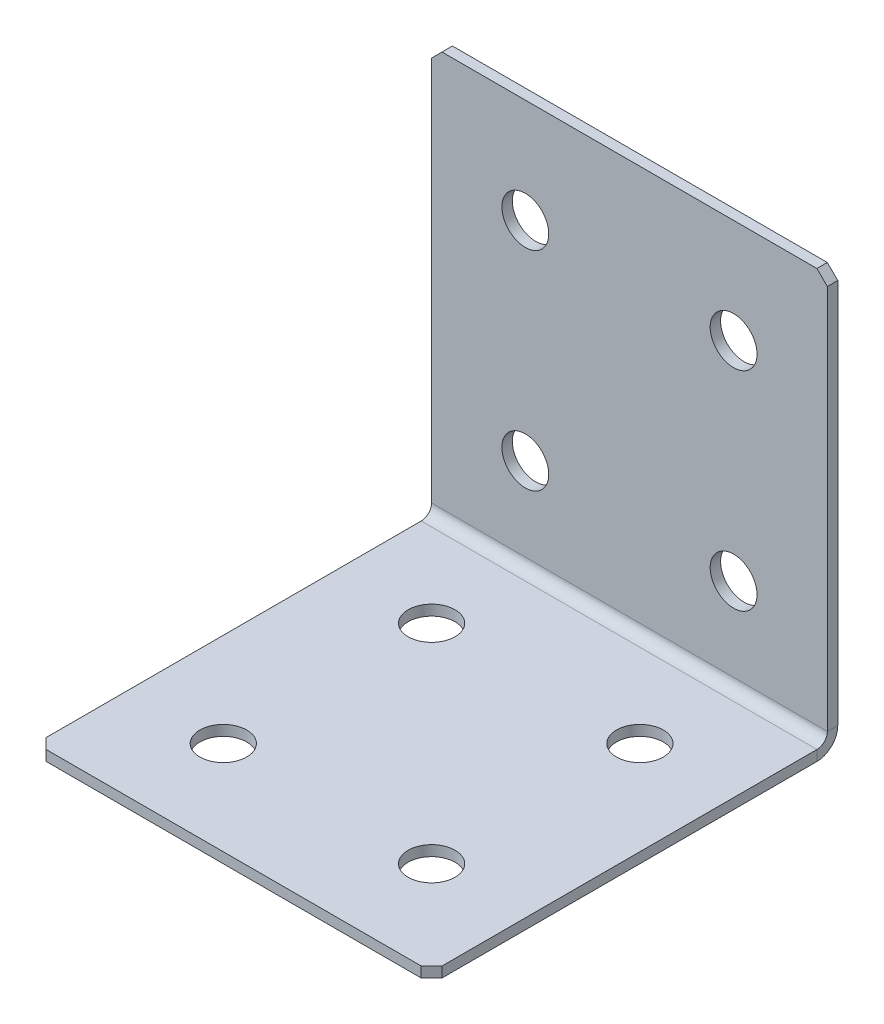
ISO-10303-21;
HEADER;
FILE_DESCRIPTION(('STEP AP214'),'2;1');
FILE_NAME('part.step','',(''),(''),'','','');
FILE_SCHEMA(('AUTOMOTIVE_DESIGN { 1 0 10303 214 1 1 1 1 }'));
ENDSEC;
DATA;
#1=APPLICATION_CONTEXT('core data for automotive mechanical design processes');
#2=APPLICATION_PROTOCOL_DEFINITION('international standard','automotive_design',2000,#1);
#3=PRODUCT_CONTEXT('',#1,'mechanical');
#4=PRODUCT('Part','Part','',(#3));
#5=PRODUCT_RELATED_PRODUCT_CATEGORY('part','',(#4));
#6=PRODUCT_DEFINITION_FORMATION('','',#4);
#7=PRODUCT_DEFINITION_CONTEXT('part definition',#1,'design');
#8=PRODUCT_DEFINITION('design','',#6,#7);
#9=PRODUCT_DEFINITION_SHAPE('','',#8);
#10=(LENGTH_UNIT() NAMED_UNIT(*) SI_UNIT(.MILLI.,.METRE.));
#11=(NAMED_UNIT(*) PLANE_ANGLE_UNIT() SI_UNIT($,.RADIAN.));
#12=(NAMED_UNIT(*) SI_UNIT($,.STERADIAN.) SOLID_ANGLE_UNIT());
#13=UNCERTAINTY_MEASURE_WITH_UNIT(LENGTH_MEASURE(1.E-05),#10,'distance_accuracy_value','');
#14=(GEOMETRIC_REPRESENTATION_CONTEXT(3) GLOBAL_UNCERTAINTY_ASSIGNED_CONTEXT((#13)) GLOBAL_UNIT_ASSIGNED_CONTEXT((#10,
#11,#12)) REPRESENTATION_CONTEXT('',''));
#15=CARTESIAN_POINT('',(0.,0.,0.));
#16=DIRECTION('',(0.,0.,1.));
#17=DIRECTION('',(1.,0.,0.));
#18=AXIS2_PLACEMENT_3D('',#15,#16,#17);
#19=CARTESIAN_POINT('',(0.,0.,2.));
#20=DIRECTION('',(0.,0.,-1.));
#21=DIRECTION('',(-1.,0.,0.));
#22=AXIS2_PLACEMENT_3D('',#19,#20,#21);
#23=PLANE('',#22);
#24=DIRECTION('',(0.,1.,0.));
#25=VECTOR('',#24,1.);
#26=CARTESIAN_POINT('',(38.,0.,2.));
#27=LINE('',#26,#25);
#28=CARTESIAN_POINT('',(38.,3.99999999999999,2.));
#29=VERTEX_POINT('',#28);
#30=CARTESIAN_POINT('',(38.,78.,2.));
#31=VERTEX_POINT('',#30);
#32=EDGE_CURVE('E254',#29,#31,#27,.T.);
#33=ORIENTED_EDGE('',*,*,#32,.T.);
#34=DIRECTION('',(0.707106781186552,-0.707106781186543,0.));
#35=VECTOR('',#34,1.);
#36=CARTESIAN_POINT('',(38.,78.,2.));
#37=LINE('',#36,#35);
#38=CARTESIAN_POINT('',(36.,80.,2.));
#39=VERTEX_POINT('',#38);
#40=EDGE_CURVE('E303',#31,#39,#37,.F.);
#41=ORIENTED_EDGE('',*,*,#40,.T.);
#42=DIRECTION('',(-1.,0.,0.));
#43=VECTOR('',#42,1.);
#44=CARTESIAN_POINT('',(-38.,80.,2.));
#45=LINE('',#44,#43);
#46=CARTESIAN_POINT('',(-36.,80.,2.));
#47=VERTEX_POINT('',#46);
#48=EDGE_CURVE('E259',#39,#47,#45,.T.);
#49=ORIENTED_EDGE('',*,*,#48,.T.);
#50=DIRECTION('',(0.707106781186545,0.70710678118655,0.));
#51=VECTOR('',#50,1.);
#52=CARTESIAN_POINT('',(-36.,80.,2.));
#53=LINE('',#52,#51);
#54=CARTESIAN_POINT('',(-38.,78.,2.));
#55=VERTEX_POINT('',#54);
#56=EDGE_CURVE('E300',#47,#55,#53,.F.);
#57=ORIENTED_EDGE('',*,*,#56,.T.);
#58=DIRECTION('',(0.,-1.,0.));
#59=VECTOR('',#58,1.);
#60=CARTESIAN_POINT('',(-38.,0.,2.));
#61=LINE('',#60,#59);
#62=CARTESIAN_POINT('',(-38.,3.99999999999999,2.));
#63=VERTEX_POINT('',#62);
#64=EDGE_CURVE('E251',#55,#63,#61,.T.);
#65=ORIENTED_EDGE('',*,*,#64,.T.);
#66=DIRECTION('',(1.,0.,0.));
#67=VECTOR('',#66,1.);
#68=CARTESIAN_POINT('',(38.,3.99999999999999,2.));
#69=LINE('',#68,#67);
#70=EDGE_CURVE('E238',#29,#63,#69,.F.);
#71=ORIENTED_EDGE('',*,*,#70,.F.);
#72=EDGE_LOOP('',(#33,#41,#49,#57,#65,#71));
#73=FACE_BOUND('',#72,.T.);
#74=CARTESIAN_POINT('',(20.,59.9999999999999,2.));
#75=DIRECTION('',(0.,0.,1.));
#76=DIRECTION('',(1.,0.,0.));
#77=AXIS2_PLACEMENT_3D('',#74,#75,#76);
#78=CIRCLE('',#77,4.5);
#79=CARTESIAN_POINT('',(24.5,59.9999999999999,2.));
#80=VERTEX_POINT('',#79);
#81=EDGE_CURVE('E759',#80,#80,#78,.T.);
#82=ORIENTED_EDGE('',*,*,#81,.F.);
#83=EDGE_LOOP('',(#82));
#84=FACE_BOUND('',#83,.T.);
#85=CARTESIAN_POINT('',(-20.,59.9999999999999,2.));
#86=DIRECTION('',(0.,0.,1.));
#87=DIRECTION('',(1.,0.,0.));
#88=AXIS2_PLACEMENT_3D('',#85,#86,#87);
#89=CIRCLE('',#88,4.5);
#90=CARTESIAN_POINT('',(-15.5,59.9999999999999,2.));
#91=VERTEX_POINT('',#90);
#92=EDGE_CURVE('E751',#91,#91,#89,.T.);
#93=ORIENTED_EDGE('',*,*,#92,.F.);
#94=EDGE_LOOP('',(#93));
#95=FACE_BOUND('',#94,.T.);
#96=CARTESIAN_POINT('',(20.,19.9999999999999,2.));
#97=DIRECTION('',(0.,0.,1.));
#98=DIRECTION('',(1.,0.,0.));
#99=AXIS2_PLACEMENT_3D('',#96,#97,#98);
#100=CIRCLE('',#99,4.5);
#101=CARTESIAN_POINT('',(24.5,19.9999999999999,2.));
#102=VERTEX_POINT('',#101);
#103=EDGE_CURVE('E743',#102,#102,#100,.T.);
#104=ORIENTED_EDGE('',*,*,#103,.F.);
#105=EDGE_LOOP('',(#104));
#106=FACE_BOUND('',#105,.T.);
#107=CARTESIAN_POINT('',(-20.,19.9999999999999,2.));
#108=DIRECTION('',(0.,0.,1.));
#109=DIRECTION('',(1.,0.,0.));
#110=AXIS2_PLACEMENT_3D('',#107,#108,#109);
#111=CIRCLE('',#110,4.5);
#112=CARTESIAN_POINT('',(-15.5,19.9999999999999,2.));
#113=VERTEX_POINT('',#112);
#114=EDGE_CURVE('E726',#113,#113,#111,.T.);
#115=ORIENTED_EDGE('',*,*,#114,.F.);
#116=EDGE_LOOP('',(#115));
#117=FACE_BOUND('',#116,.T.);
#118=ADVANCED_FACE('F70',(#73,#84,#95,#106,#117),#23,.F.);
#119=CARTESIAN_POINT('',(38.,0.,2.));
#120=DIRECTION('',(-1.,0.,0.));
#121=DIRECTION('',(0.,1.,0.));
#122=AXIS2_PLACEMENT_3D('',#119,#120,#121);
#123=PLANE('',#122);
#124=DIRECTION('',(0.,1.,0.));
#125=VECTOR('',#124,1.);
#126=CARTESIAN_POINT('',(38.,0.,0.));
#127=LINE('',#126,#125);
#128=CARTESIAN_POINT('',(38.,3.99999999999999,0.));
#129=VERTEX_POINT('',#128);
#130=CARTESIAN_POINT('',(38.,78.,0.));
#131=VERTEX_POINT('',#130);
#132=EDGE_CURVE('E266',#129,#131,#127,.T.);
#133=ORIENTED_EDGE('',*,*,#132,.T.);
#134=DIRECTION('',(0.,0.,-1.));
#135=VECTOR('',#134,1.);
#136=CARTESIAN_POINT('',(38.,78.,2.));
#137=LINE('',#136,#135);
#138=EDGE_CURVE('E296',#131,#31,#137,.F.);
#139=ORIENTED_EDGE('',*,*,#138,.T.);
#140=ORIENTED_EDGE('',*,*,#32,.F.);
#141=DIRECTION('',(0.,0.,-1.));
#142=VECTOR('',#141,1.);
#143=CARTESIAN_POINT('',(38.,3.99999999999999,2.));
#144=LINE('',#143,#142);
#145=EDGE_CURVE('E233',#29,#129,#144,.T.);
#146=ORIENTED_EDGE('',*,*,#145,.T.);
#147=EDGE_LOOP('',(#133,#139,#140,#146));
#148=FACE_BOUND('',#147,.T.);
#149=ADVANCED_FACE('F324',(#148),#123,.F.);
#150=CARTESIAN_POINT('',(0.,0.,0.));
#151=DIRECTION('',(0.,0.,-1.));
#152=DIRECTION('',(-1.,0.,0.));
#153=AXIS2_PLACEMENT_3D('',#150,#151,#152);
#154=PLANE('',#153);
#155=CARTESIAN_POINT('',(-20.,19.9999999999999,0.));
#156=DIRECTION('',(0.,0.,-1.));
#157=DIRECTION('',(-1.,0.,0.));
#158=AXIS2_PLACEMENT_3D('',#155,#156,#157);
#159=CIRCLE('',#158,4.5);
#160=CARTESIAN_POINT('',(-24.5,19.9999999999999,0.));
#161=VERTEX_POINT('',#160);
#162=EDGE_CURVE('E734',#161,#161,#159,.T.);
#163=ORIENTED_EDGE('',*,*,#162,.F.);
#164=EDGE_LOOP('',(#163));
#165=FACE_BOUND('',#164,.T.);
#166=CARTESIAN_POINT('',(20.,19.9999999999999,0.));
#167=DIRECTION('',(0.,0.,-1.));
#168=DIRECTION('',(-1.,0.,0.));
#169=AXIS2_PLACEMENT_3D('',#166,#167,#168);
#170=CIRCLE('',#169,4.5);
#171=CARTESIAN_POINT('',(15.5,19.9999999999999,0.));
#172=VERTEX_POINT('',#171);
#173=EDGE_CURVE('E747',#172,#172,#170,.T.);
#174=ORIENTED_EDGE('',*,*,#173,.F.);
#175=EDGE_LOOP('',(#174));
#176=FACE_BOUND('',#175,.T.);
#177=CARTESIAN_POINT('',(-20.,59.9999999999999,0.));
#178=DIRECTION('',(0.,0.,-1.));
#179=DIRECTION('',(-1.,0.,0.));
#180=AXIS2_PLACEMENT_3D('',#177,#178,#179);
#181=CIRCLE('',#180,4.5);
#182=CARTESIAN_POINT('',(-24.5,59.9999999999999,0.));
#183=VERTEX_POINT('',#182);
#184=EDGE_CURVE('E755',#183,#183,#181,.T.);
#185=ORIENTED_EDGE('',*,*,#184,.F.);
#186=EDGE_LOOP('',(#185));
#187=FACE_BOUND('',#186,.T.);
#188=CARTESIAN_POINT('',(20.,59.9999999999999,0.));
#189=DIRECTION('',(0.,0.,-1.));
#190=DIRECTION('',(-1.,0.,0.));
#191=AXIS2_PLACEMENT_3D('',#188,#189,#190);
#192=CIRCLE('',#191,4.5);
#193=CARTESIAN_POINT('',(15.5,59.9999999999999,0.));
#194=VERTEX_POINT('',#193);
#195=EDGE_CURVE('E228',#194,#194,#192,.T.);
#196=ORIENTED_EDGE('',*,*,#195,.F.);
#197=EDGE_LOOP('',(#196));
#198=FACE_BOUND('',#197,.T.);
#199=DIRECTION('',(-1.,0.,0.));
#200=VECTOR('',#199,1.);
#201=CARTESIAN_POINT('',(0.,80.,0.));
#202=LINE('',#201,#200);
#203=CARTESIAN_POINT('',(36.,80.,0.));
#204=VERTEX_POINT('',#203);
#205=CARTESIAN_POINT('',(-36.,80.,0.));
#206=VERTEX_POINT('',#205);
#207=EDGE_CURVE('E255',#204,#206,#202,.T.);
#208=ORIENTED_EDGE('',*,*,#207,.F.);
#209=DIRECTION('',(-0.707106781186552,0.707106781186543,0.));
#210=VECTOR('',#209,1.);
#211=CARTESIAN_POINT('',(57.9999999999997,58.0000000000005,0.));
#212=LINE('',#211,#210);
#213=EDGE_CURVE('E80',#204,#131,#212,.F.);
#214=ORIENTED_EDGE('',*,*,#213,.T.);
#215=ORIENTED_EDGE('',*,*,#132,.F.);
#216=DIRECTION('',(1.,0.,0.));
#217=VECTOR('',#216,1.);
#218=CARTESIAN_POINT('',(38.,3.99999999999999,0.));
#219=LINE('',#218,#217);
#220=CARTESIAN_POINT('',(-38.,4.00000000000001,0.));
#221=VERTEX_POINT('',#220);
#222=EDGE_CURVE('E169',#129,#221,#219,.F.);
#223=ORIENTED_EDGE('',*,*,#222,.T.);
#224=DIRECTION('',(0.,1.,0.));
#225=VECTOR('',#224,1.);
#226=CARTESIAN_POINT('',(-38.,0.,0.));
#227=LINE('',#226,#225);
#228=CARTESIAN_POINT('',(-38.,78.,0.));
#229=VERTEX_POINT('',#228);
#230=EDGE_CURVE('E248',#229,#221,#227,.F.);
#231=ORIENTED_EDGE('',*,*,#230,.F.);
#232=DIRECTION('',(-0.707106781186545,-0.70710678118655,0.));
#233=VECTOR('',#232,1.);
#234=CARTESIAN_POINT('',(-58.0000000000001,57.9999999999997,0.));
#235=LINE('',#234,#233);
#236=EDGE_CURVE('E92',#229,#206,#235,.F.);
#237=ORIENTED_EDGE('',*,*,#236,.T.);
#238=EDGE_LOOP('',(#208,#214,#215,#223,#231,#237));
#239=FACE_BOUND('',#238,.T.);
#240=ADVANCED_FACE('F319',(#165,#176,#187,#198,#239),#154,.T.);
#241=CARTESIAN_POINT('',(-38.,80.,2.));
#242=DIRECTION('',(0.,-1.,0.));
#243=DIRECTION('',(-1.,0.,0.));
#244=AXIS2_PLACEMENT_3D('',#241,#242,#243);
#245=PLANE('',#244);
#246=ORIENTED_EDGE('',*,*,#48,.F.);
#247=DIRECTION('',(0.,0.,1.));
#248=VECTOR('',#247,1.);
#249=CARTESIAN_POINT('',(36.,80.,2.));
#250=LINE('',#249,#248);
#251=EDGE_CURVE('E310',#39,#204,#250,.F.);
#252=ORIENTED_EDGE('',*,*,#251,.T.);
#253=ORIENTED_EDGE('',*,*,#207,.T.);
#254=DIRECTION('',(0.,0.,-1.));
#255=VECTOR('',#254,1.);
#256=CARTESIAN_POINT('',(-36.,80.,2.));
#257=LINE('',#256,#255);
#258=EDGE_CURVE('E306',#206,#47,#257,.F.);
#259=ORIENTED_EDGE('',*,*,#258,.T.);
#260=EDGE_LOOP('',(#246,#252,#253,#259));
#261=FACE_BOUND('',#260,.T.);
#262=ADVANCED_FACE('F332',(#261),#245,.F.);
#263=CARTESIAN_POINT('',(-38.,0.,2.));
#264=DIRECTION('',(1.,0.,0.));
#265=DIRECTION('',(0.,-1.,0.));
#266=AXIS2_PLACEMENT_3D('',#263,#264,#265);
#267=PLANE('',#266);
#268=ORIENTED_EDGE('',*,*,#64,.F.);
#269=DIRECTION('',(0.,0.,1.));
#270=VECTOR('',#269,1.);
#271=CARTESIAN_POINT('',(-38.,78.,2.));
#272=LINE('',#271,#270);
#273=EDGE_CURVE('E13',#55,#229,#272,.F.);
#274=ORIENTED_EDGE('',*,*,#273,.T.);
#275=ORIENTED_EDGE('',*,*,#230,.T.);
#276=DIRECTION('',(0.,0.,-1.));
#277=VECTOR('',#276,1.);
#278=CARTESIAN_POINT('',(-38.,3.99999999999999,2.));
#279=LINE('',#278,#277);
#280=EDGE_CURVE('E244',#63,#221,#279,.T.);
#281=ORIENTED_EDGE('',*,*,#280,.F.);
#282=EDGE_LOOP('',(#268,#274,#275,#281));
#283=FACE_BOUND('',#282,.T.);
#284=ADVANCED_FACE('F336',(#283),#267,.F.);
#285=CARTESIAN_POINT('',(-38.,3.99999999999999,4.));
#286=DIRECTION('',(-1.,0.,0.));
#287=DIRECTION('',(0.,0.,1.));
#288=AXIS2_PLACEMENT_3D('',#285,#286,#287);
#289=PLANE('',#288);
#290=DIRECTION('',(0.,1.,0.));
#291=VECTOR('',#290,1.);
#292=CARTESIAN_POINT('',(-38.,0.,3.99999999999999));
#293=LINE('',#292,#291);
#294=CARTESIAN_POINT('',(-38.,1.99999999999999,3.99999999999999));
#295=VERTEX_POINT('',#294);
#296=CARTESIAN_POINT('',(-38.,0.,3.99999999999999));
#297=VERTEX_POINT('',#296);
#298=EDGE_CURVE('E224',#295,#297,#293,.F.);
#299=ORIENTED_EDGE('',*,*,#298,.F.);
#300=CARTESIAN_POINT('',(-38.,3.99999999999999,4.));
#301=DIRECTION('',(1.,0.,0.));
#302=DIRECTION('',(0.,0.,-1.));
#303=AXIS2_PLACEMENT_3D('',#300,#301,#302);
#304=CIRCLE('',#303,2.);
#305=EDGE_CURVE('E173',#63,#295,#304,.F.);
#306=ORIENTED_EDGE('',*,*,#305,.F.);
#307=ORIENTED_EDGE('',*,*,#280,.T.);
#308=CARTESIAN_POINT('',(-38.,3.99999999999999,4.));
#309=DIRECTION('',(1.,0.,0.));
#310=DIRECTION('',(0.,0.,-1.));
#311=AXIS2_PLACEMENT_3D('',#308,#309,#310);
#312=CIRCLE('',#311,4.);
#313=EDGE_CURVE('E231',#221,#297,#312,.F.);
#314=ORIENTED_EDGE('',*,*,#313,.T.);
#315=EDGE_LOOP('',(#299,#306,#307,#314));
#316=FACE_BOUND('',#315,.T.);
#317=ADVANCED_FACE('F340',(#316),#289,.T.);
#318=CARTESIAN_POINT('',(38.,3.99999999999999,4.));
#319=DIRECTION('',(-1.,0.,0.));
#320=DIRECTION('',(0.,0.,1.));
#321=AXIS2_PLACEMENT_3D('',#318,#319,#320);
#322=PLANE('',#321);
#323=CARTESIAN_POINT('',(38.,3.99999999999999,4.));
#324=DIRECTION('',(1.,0.,0.));
#325=DIRECTION('',(0.,0.,-1.));
#326=AXIS2_PLACEMENT_3D('',#323,#324,#325);
#327=CIRCLE('',#326,2.);
#328=CARTESIAN_POINT('',(38.,1.99999999999999,3.99999999999999));
#329=VERTEX_POINT('',#328);
#330=EDGE_CURVE('E180',#329,#29,#327,.T.);
#331=ORIENTED_EDGE('',*,*,#330,.F.);
#332=DIRECTION('',(0.,1.,0.));
#333=VECTOR('',#332,1.);
#334=CARTESIAN_POINT('',(38.,1.99999999999999,3.99999999999999));
#335=LINE('',#334,#333);
#336=CARTESIAN_POINT('',(38.,0.,3.99999999999999));
#337=VERTEX_POINT('',#336);
#338=EDGE_CURVE('E177',#329,#337,#335,.F.);
#339=ORIENTED_EDGE('',*,*,#338,.T.);
#340=CARTESIAN_POINT('',(38.,3.99999999999999,4.));
#341=DIRECTION('',(1.,0.,0.));
#342=DIRECTION('',(0.,0.,-1.));
#343=AXIS2_PLACEMENT_3D('',#340,#341,#342);
#344=CIRCLE('',#343,4.);
#345=EDGE_CURVE('E161',#337,#129,#344,.T.);
#346=ORIENTED_EDGE('',*,*,#345,.T.);
#347=ORIENTED_EDGE('',*,*,#145,.F.);
#348=EDGE_LOOP('',(#331,#339,#346,#347));
#349=FACE_BOUND('',#348,.T.);
#350=ADVANCED_FACE('F178',(#349),#322,.F.);
#351=CARTESIAN_POINT('',(38.,3.99999999999999,4.));
#352=DIRECTION('',(1.,0.,0.));
#353=DIRECTION('',(0.,-1.,0.));
#354=AXIS2_PLACEMENT_3D('',#351,#352,#353);
#355=CYLINDRICAL_SURFACE('',#354,4.);
#356=ORIENTED_EDGE('',*,*,#222,.F.);
#357=ORIENTED_EDGE('',*,*,#345,.F.);
#358=DIRECTION('',(1.,0.,0.));
#359=VECTOR('',#358,1.);
#360=CARTESIAN_POINT('',(-38.,0.,3.99999999999999));
#361=LINE('',#360,#359);
#362=EDGE_CURVE('E166',#337,#297,#361,.F.);
#363=ORIENTED_EDGE('',*,*,#362,.T.);
#364=ORIENTED_EDGE('',*,*,#313,.F.);
#365=EDGE_LOOP('',(#356,#357,#363,#364));
#366=FACE_BOUND('',#365,.T.);
#367=ADVANCED_FACE('F163',(#366),#355,.T.);
#368=CARTESIAN_POINT('',(38.,3.99999999999999,4.));
#369=DIRECTION('',(1.,0.,0.));
#370=DIRECTION('',(0.,-1.,0.));
#371=AXIS2_PLACEMENT_3D('',#368,#369,#370);
#372=CYLINDRICAL_SURFACE('',#371,2.);
#373=ORIENTED_EDGE('',*,*,#70,.T.);
#374=ORIENTED_EDGE('',*,*,#305,.T.);
#375=DIRECTION('',(1.,0.,0.));
#376=VECTOR('',#375,1.);
#377=CARTESIAN_POINT('',(-38.,1.99999999999999,3.99999999999999));
#378=LINE('',#377,#376);
#379=EDGE_CURVE('E186',#295,#329,#378,.T.);
#380=ORIENTED_EDGE('',*,*,#379,.T.);
#381=ORIENTED_EDGE('',*,*,#330,.T.);
#382=EDGE_LOOP('',(#373,#374,#380,#381));
#383=FACE_BOUND('',#382,.T.);
#384=ADVANCED_FACE('F343',(#383),#372,.F.);
#385=CARTESIAN_POINT('',(-38.,0.,1.99999999999999));
#386=DIRECTION('',(1.,0.,0.));
#387=DIRECTION('',(0.,0.,-1.));
#388=AXIS2_PLACEMENT_3D('',#385,#386,#387);
#389=PLANE('',#388);
#390=DIRECTION('',(0.,0.,-1.));
#391=VECTOR('',#390,1.);
#392=CARTESIAN_POINT('',(-38.,0.,0.));
#393=LINE('',#392,#391);
#394=CARTESIAN_POINT('',(-38.,-2.58413687848171E-13,76.));
#395=VERTEX_POINT('',#394);
#396=EDGE_CURVE('E194',#395,#297,#393,.T.);
#397=ORIENTED_EDGE('',*,*,#396,.F.);
#398=DIRECTION('',(0.,1.,0.));
#399=VECTOR('',#398,1.);
#400=CARTESIAN_POINT('',(-38.,-2.58369619074392E-13,76.));
#401=LINE('',#400,#399);
#402=CARTESIAN_POINT('',(-38.,1.99999999999974,76.));
#403=VERTEX_POINT('',#402);
#404=EDGE_CURVE('E292',#395,#403,#401,.T.);
#405=ORIENTED_EDGE('',*,*,#404,.T.);
#406=DIRECTION('',(0.,0.,1.));
#407=VECTOR('',#406,1.);
#408=CARTESIAN_POINT('',(-38.,2.,2.));
#409=LINE('',#408,#407);
#410=EDGE_CURVE('E196',#403,#295,#409,.F.);
#411=ORIENTED_EDGE('',*,*,#410,.T.);
#412=ORIENTED_EDGE('',*,*,#298,.T.);
#413=EDGE_LOOP('',(#397,#405,#411,#412));
#414=FACE_BOUND('',#413,.T.);
#415=ADVANCED_FACE('F360',(#414),#389,.F.);
#416=CARTESIAN_POINT('',(38.,-2.65412691824451E-13,78.));
#417=DIRECTION('',(-1.,0.,0.));
#418=DIRECTION('',(0.,0.,1.));
#419=AXIS2_PLACEMENT_3D('',#416,#417,#418);
#420=PLANE('',#419);
#421=DIRECTION('',(0.,0.,-1.));
#422=VECTOR('',#421,1.);
#423=CARTESIAN_POINT('',(38.,1.99999999999973,78.));
#424=LINE('',#423,#422);
#425=CARTESIAN_POINT('',(38.,1.99999999999974,76.));
#426=VERTEX_POINT('',#425);
#427=EDGE_CURVE('E217',#329,#426,#424,.F.);
#428=ORIENTED_EDGE('',*,*,#427,.T.);
#429=DIRECTION('',(0.,-1.,0.));
#430=VECTOR('',#429,1.);
#431=CARTESIAN_POINT('',(38.,-2.58429729146765E-13,76.));
#432=LINE('',#431,#430);
#433=CARTESIAN_POINT('',(38.,-2.58413687848171E-13,76.));
#434=VERTEX_POINT('',#433);
#435=EDGE_CURVE('E200',#426,#434,#432,.T.);
#436=ORIENTED_EDGE('',*,*,#435,.T.);
#437=DIRECTION('',(0.,0.,1.));
#438=VECTOR('',#437,1.);
#439=CARTESIAN_POINT('',(38.,0.,0.));
#440=LINE('',#439,#438);
#441=EDGE_CURVE('E191',#337,#434,#440,.T.);
#442=ORIENTED_EDGE('',*,*,#441,.F.);
#443=ORIENTED_EDGE('',*,*,#338,.F.);
#444=EDGE_LOOP('',(#428,#436,#442,#443));
#445=FACE_BOUND('',#444,.T.);
#446=ADVANCED_FACE('F198',(#445),#420,.F.);
#447=CARTESIAN_POINT('',(0.,0.,0.));
#448=DIRECTION('',(0.,1.,0.));
#449=DIRECTION('',(0.,0.,1.));
#450=AXIS2_PLACEMENT_3D('',#447,#448,#449);
#451=PLANE('',#450);
#452=CARTESIAN_POINT('',(-20.,0.,20.));
#453=DIRECTION('',(0.,1.,0.));
#454=DIRECTION('',(0.,0.,1.));
#455=AXIS2_PLACEMENT_3D('',#452,#453,#454);
#456=CIRCLE('',#455,4.5);
#457=CARTESIAN_POINT('',(-20.,0.,24.5));
#458=VERTEX_POINT('',#457);
#459=EDGE_CURVE('E713',#458,#458,#456,.T.);
#460=ORIENTED_EDGE('',*,*,#459,.T.);
#461=EDGE_LOOP('',(#460));
#462=FACE_BOUND('',#461,.T.);
#463=CARTESIAN_POINT('',(20.,0.,20.));
#464=DIRECTION('',(0.,1.,0.));
#465=DIRECTION('',(0.,0.,1.));
#466=AXIS2_PLACEMENT_3D('',#463,#464,#465);
#467=CIRCLE('',#466,4.5);
#468=CARTESIAN_POINT('',(20.,0.,24.5));
#469=VERTEX_POINT('',#468);
#470=EDGE_CURVE('E717',#469,#469,#467,.T.);
#471=ORIENTED_EDGE('',*,*,#470,.T.);
#472=EDGE_LOOP('',(#471));
#473=FACE_BOUND('',#472,.T.);
#474=CARTESIAN_POINT('',(20.,-2.02528965820292E-13,60.));
#475=DIRECTION('',(0.,1.,0.));
#476=DIRECTION('',(0.,0.,1.));
#477=AXIS2_PLACEMENT_3D('',#474,#475,#476);
#478=CIRCLE('',#477,4.5);
#479=CARTESIAN_POINT('',(20.,-2.18240631845086E-13,64.5));
#480=VERTEX_POINT('',#479);
#481=EDGE_CURVE('E721',#480,#480,#478,.T.);
#482=ORIENTED_EDGE('',*,*,#481,.T.);
#483=EDGE_LOOP('',(#482));
#484=FACE_BOUND('',#483,.T.);
#485=CARTESIAN_POINT('',(-20.,-2.02528965820292E-13,60.));
#486=DIRECTION('',(0.,1.,0.));
#487=DIRECTION('',(0.,0.,1.));
#488=AXIS2_PLACEMENT_3D('',#485,#486,#487);
#489=CIRCLE('',#488,4.5);
#490=CARTESIAN_POINT('',(-20.,-2.18240631845086E-13,64.5));
#491=VERTEX_POINT('',#490);
#492=EDGE_CURVE('E724',#491,#491,#489,.T.);
#493=ORIENTED_EDGE('',*,*,#492,.T.);
#494=EDGE_LOOP('',(#493));
#495=FACE_BOUND('',#494,.T.);
#496=ORIENTED_EDGE('',*,*,#441,.T.);
#497=DIRECTION('',(0.707106781186548,0.,-0.707106781186548));
#498=VECTOR('',#497,1.);
#499=CARTESIAN_POINT('',(36.,-2.65412691824451E-13,78.));
#500=LINE('',#499,#498);
#501=CARTESIAN_POINT('',(36.,-2.65396650525857E-13,78.));
#502=VERTEX_POINT('',#501);
#503=EDGE_CURVE('E289',#434,#502,#500,.F.);
#504=ORIENTED_EDGE('',*,*,#503,.T.);
#505=DIRECTION('',(-1.,0.,0.));
#506=VECTOR('',#505,1.);
#507=CARTESIAN_POINT('',(0.,-2.65396650525857E-13,78.));
#508=LINE('',#507,#506);
#509=CARTESIAN_POINT('',(-36.,-2.65396650525857E-13,78.));
#510=VERTEX_POINT('',#509);
#511=EDGE_CURVE('E202',#502,#510,#508,.T.);
#512=ORIENTED_EDGE('',*,*,#511,.T.);
#513=DIRECTION('',(0.707106781186552,0.,0.707106781186543));
#514=VECTOR('',#513,1.);
#515=CARTESIAN_POINT('',(-38.,-2.58369619074392E-13,76.));
#516=LINE('',#515,#514);
#517=EDGE_CURVE('E286',#510,#395,#516,.F.);
#518=ORIENTED_EDGE('',*,*,#517,.T.);
#519=ORIENTED_EDGE('',*,*,#396,.T.);
#520=ORIENTED_EDGE('',*,*,#362,.F.);
#521=EDGE_LOOP('',(#496,#504,#512,#518,#519,#520));
#522=FACE_BOUND('',#521,.T.);
#523=ADVANCED_FACE('F190',(#462,#473,#484,#495,#522),#451,.F.);
#524=CARTESIAN_POINT('',(0.,2.00000000000001,0.));
#525=DIRECTION('',(0.,1.,0.));
#526=DIRECTION('',(0.,0.,1.));
#527=AXIS2_PLACEMENT_3D('',#524,#525,#526);
#528=PLANE('',#527);
#529=CARTESIAN_POINT('',(-20.,1.99999999999994,20.));
#530=DIRECTION('',(0.,1.,0.));
#531=DIRECTION('',(0.,0.,1.));
#532=AXIS2_PLACEMENT_3D('',#529,#530,#531);
#533=CIRCLE('',#532,4.5);
#534=CARTESIAN_POINT('',(-20.,1.99999999999992,24.5));
#535=VERTEX_POINT('',#534);
#536=EDGE_CURVE('E797',#535,#535,#533,.T.);
#537=ORIENTED_EDGE('',*,*,#536,.F.);
#538=EDGE_LOOP('',(#537));
#539=FACE_BOUND('',#538,.T.);
#540=CARTESIAN_POINT('',(20.,1.99999999999994,20.));
#541=DIRECTION('',(0.,1.,0.));
#542=DIRECTION('',(0.,0.,1.));
#543=AXIS2_PLACEMENT_3D('',#540,#541,#542);
#544=CIRCLE('',#543,4.5);
#545=CARTESIAN_POINT('',(20.,1.99999999999992,24.5));
#546=VERTEX_POINT('',#545);
#547=EDGE_CURVE('E806',#546,#546,#544,.T.);
#548=ORIENTED_EDGE('',*,*,#547,.F.);
#549=EDGE_LOOP('',(#548));
#550=FACE_BOUND('',#549,.T.);
#551=CARTESIAN_POINT('',(20.,1.9999999999998,60.));
#552=DIRECTION('',(0.,1.,0.));
#553=DIRECTION('',(0.,0.,1.));
#554=AXIS2_PLACEMENT_3D('',#551,#552,#553);
#555=CIRCLE('',#554,4.5);
#556=CARTESIAN_POINT('',(20.,1.99999999999978,64.5));
#557=VERTEX_POINT('',#556);
#558=EDGE_CURVE('E830',#557,#557,#555,.T.);
#559=ORIENTED_EDGE('',*,*,#558,.F.);
#560=EDGE_LOOP('',(#559));
#561=FACE_BOUND('',#560,.T.);
#562=CARTESIAN_POINT('',(-20.,1.9999999999998,60.));
#563=DIRECTION('',(0.,1.,0.));
#564=DIRECTION('',(0.,0.,1.));
#565=AXIS2_PLACEMENT_3D('',#562,#563,#564);
#566=CIRCLE('',#565,4.5);
#567=CARTESIAN_POINT('',(-20.,1.99999999999978,64.5));
#568=VERTEX_POINT('',#567);
#569=EDGE_CURVE('E727',#568,#568,#566,.T.);
#570=ORIENTED_EDGE('',*,*,#569,.F.);
#571=EDGE_LOOP('',(#570));
#572=FACE_BOUND('',#571,.T.);
#573=DIRECTION('',(1.,0.,0.));
#574=VECTOR('',#573,1.);
#575=CARTESIAN_POINT('',(-38.,1.99999999999973,78.));
#576=LINE('',#575,#574);
#577=CARTESIAN_POINT('',(36.,1.99999999999973,78.));
#578=VERTEX_POINT('',#577);
#579=CARTESIAN_POINT('',(-36.,1.99999999999973,78.));
#580=VERTEX_POINT('',#579);
#581=EDGE_CURVE('E210',#578,#580,#576,.F.);
#582=ORIENTED_EDGE('',*,*,#581,.F.);
#583=DIRECTION('',(-0.707106781186548,0.,0.707106781186548));
#584=VECTOR('',#583,1.);
#585=CARTESIAN_POINT('',(57.,1.99999999999981,57.));
#586=LINE('',#585,#584);
#587=EDGE_CURVE('E281',#578,#426,#586,.F.);
#588=ORIENTED_EDGE('',*,*,#587,.T.);
#589=ORIENTED_EDGE('',*,*,#427,.F.);
#590=ORIENTED_EDGE('',*,*,#379,.F.);
#591=ORIENTED_EDGE('',*,*,#410,.F.);
#592=DIRECTION('',(-0.707106781186552,0.,-0.707106781186543));
#593=VECTOR('',#592,1.);
#594=CARTESIAN_POINT('',(-56.9999999999997,1.99999999999981,57.0000000000005));
#595=LINE('',#594,#593);
#596=EDGE_CURVE('E278',#403,#580,#595,.F.);
#597=ORIENTED_EDGE('',*,*,#596,.T.);
#598=EDGE_LOOP('',(#582,#588,#589,#590,#591,#597));
#599=FACE_BOUND('',#598,.T.);
#600=ADVANCED_FACE('F347',(#539,#550,#561,#572,#599),#528,.T.);
#601=CARTESIAN_POINT('',(-38.,-2.65412691824451E-13,78.));
#602=DIRECTION('',(0.,0.,-1.));
#603=DIRECTION('',(0.,1.,0.));
#604=AXIS2_PLACEMENT_3D('',#601,#602,#603);
#605=PLANE('',#604);
#606=ORIENTED_EDGE('',*,*,#511,.F.);
#607=DIRECTION('',(0.,1.,0.));
#608=VECTOR('',#607,1.);
#609=CARTESIAN_POINT('',(36.,-2.65412691824451E-13,78.));
#610=LINE('',#609,#608);
#611=EDGE_CURVE('E274',#502,#578,#610,.T.);
#612=ORIENTED_EDGE('',*,*,#611,.T.);
#613=ORIENTED_EDGE('',*,*,#581,.T.);
#614=DIRECTION('',(0.,-1.,0.));
#615=VECTOR('',#614,1.);
#616=CARTESIAN_POINT('',(-36.,-2.65412691824451E-13,78.));
#617=LINE('',#616,#615);
#618=EDGE_CURVE('E263',#580,#510,#617,.T.);
#619=ORIENTED_EDGE('',*,*,#618,.T.);
#620=EDGE_LOOP('',(#606,#612,#613,#619));
#621=FACE_BOUND('',#620,.T.);
#622=ADVANCED_FACE('F354',(#621),#605,.F.);
#623=CARTESIAN_POINT('',(20.,59.9999999999999,2.));
#624=DIRECTION('',(0.,0.,1.));
#625=DIRECTION('',(1.,0.,0.));
#626=AXIS2_PLACEMENT_3D('',#623,#624,#625);
#627=CYLINDRICAL_SURFACE('',#626,4.5);
#628=ORIENTED_EDGE('',*,*,#81,.T.);
#629=EDGE_LOOP('',(#628));
#630=FACE_BOUND('',#629,.T.);
#631=ORIENTED_EDGE('',*,*,#195,.T.);
#632=EDGE_LOOP('',(#631));
#633=FACE_BOUND('',#632,.T.);
#634=ADVANCED_FACE('F480',(#630,#633),#627,.F.);
#635=CARTESIAN_POINT('',(-20.,59.9999999999999,2.));
#636=DIRECTION('',(0.,0.,1.));
#637=DIRECTION('',(1.,0.,0.));
#638=AXIS2_PLACEMENT_3D('',#635,#636,#637);
#639=CYLINDRICAL_SURFACE('',#638,4.5);
#640=ORIENTED_EDGE('',*,*,#92,.T.);
#641=EDGE_LOOP('',(#640));
#642=FACE_BOUND('',#641,.T.);
#643=ORIENTED_EDGE('',*,*,#184,.T.);
#644=EDGE_LOOP('',(#643));
#645=FACE_BOUND('',#644,.T.);
#646=ADVANCED_FACE('F471',(#642,#645),#639,.F.);
#647=CARTESIAN_POINT('',(20.,19.9999999999999,2.));
#648=DIRECTION('',(0.,0.,1.));
#649=DIRECTION('',(1.,0.,0.));
#650=AXIS2_PLACEMENT_3D('',#647,#648,#649);
#651=CYLINDRICAL_SURFACE('',#650,4.5);
#652=ORIENTED_EDGE('',*,*,#103,.T.);
#653=EDGE_LOOP('',(#652));
#654=FACE_BOUND('',#653,.T.);
#655=ORIENTED_EDGE('',*,*,#173,.T.);
#656=EDGE_LOOP('',(#655));
#657=FACE_BOUND('',#656,.T.);
#658=ADVANCED_FACE('F462',(#654,#657),#651,.F.);
#659=CARTESIAN_POINT('',(-20.,19.9999999999999,2.));
#660=DIRECTION('',(0.,0.,1.));
#661=DIRECTION('',(1.,0.,0.));
#662=AXIS2_PLACEMENT_3D('',#659,#660,#661);
#663=CYLINDRICAL_SURFACE('',#662,4.5);
#664=ORIENTED_EDGE('',*,*,#114,.T.);
#665=EDGE_LOOP('',(#664));
#666=FACE_BOUND('',#665,.T.);
#667=ORIENTED_EDGE('',*,*,#162,.T.);
#668=EDGE_LOOP('',(#667));
#669=FACE_BOUND('',#668,.T.);
#670=ADVANCED_FACE('F453',(#666,#669),#663,.F.);
#671=CARTESIAN_POINT('',(-20.,1.9999999999998,60.));
#672=DIRECTION('',(0.,1.,0.));
#673=DIRECTION('',(0.,0.,1.));
#674=AXIS2_PLACEMENT_3D('',#671,#672,#673);
#675=CYLINDRICAL_SURFACE('',#674,4.5);
#676=ORIENTED_EDGE('',*,*,#492,.F.);
#677=EDGE_LOOP('',(#676));
#678=FACE_BOUND('',#677,.T.);
#679=ORIENTED_EDGE('',*,*,#569,.T.);
#680=EDGE_LOOP('',(#679));
#681=FACE_BOUND('',#680,.T.);
#682=ADVANCED_FACE('F444',(#678,#681),#675,.F.);
#683=CARTESIAN_POINT('',(20.,1.9999999999998,60.));
#684=DIRECTION('',(0.,1.,0.));
#685=DIRECTION('',(0.,0.,1.));
#686=AXIS2_PLACEMENT_3D('',#683,#684,#685);
#687=CYLINDRICAL_SURFACE('',#686,4.5);
#688=ORIENTED_EDGE('',*,*,#481,.F.);
#689=EDGE_LOOP('',(#688));
#690=FACE_BOUND('',#689,.T.);
#691=ORIENTED_EDGE('',*,*,#558,.T.);
#692=EDGE_LOOP('',(#691));
#693=FACE_BOUND('',#692,.T.);
#694=ADVANCED_FACE('F435',(#690,#693),#687,.F.);
#695=CARTESIAN_POINT('',(20.,1.99999999999994,20.));
#696=DIRECTION('',(0.,1.,0.));
#697=DIRECTION('',(0.,0.,1.));
#698=AXIS2_PLACEMENT_3D('',#695,#696,#697);
#699=CYLINDRICAL_SURFACE('',#698,4.5);
#700=ORIENTED_EDGE('',*,*,#470,.F.);
#701=EDGE_LOOP('',(#700));
#702=FACE_BOUND('',#701,.T.);
#703=ORIENTED_EDGE('',*,*,#547,.T.);
#704=EDGE_LOOP('',(#703));
#705=FACE_BOUND('',#704,.T.);
#706=ADVANCED_FACE('F426',(#702,#705),#699,.F.);
#707=CARTESIAN_POINT('',(-20.,1.99999999999994,20.));
#708=DIRECTION('',(0.,1.,0.));
#709=DIRECTION('',(0.,0.,1.));
#710=AXIS2_PLACEMENT_3D('',#707,#708,#709);
#711=CYLINDRICAL_SURFACE('',#710,4.5);
#712=ORIENTED_EDGE('',*,*,#459,.F.);
#713=EDGE_LOOP('',(#712));
#714=FACE_BOUND('',#713,.T.);
#715=ORIENTED_EDGE('',*,*,#536,.T.);
#716=EDGE_LOOP('',(#715));
#717=FACE_BOUND('',#716,.T.);
#718=ADVANCED_FACE('F392',(#714,#717),#711,.F.);
#719=CARTESIAN_POINT('',(36.,-2.65412691824451E-13,78.));
#720=DIRECTION('',(-0.707106781186547,0.,-0.707106781186547));
#721=DIRECTION('',(0.,1.,0.));
#722=AXIS2_PLACEMENT_3D('',#719,#720,#721);
#723=PLANE('',#722);
#724=ORIENTED_EDGE('',*,*,#503,.F.);
#725=ORIENTED_EDGE('',*,*,#435,.F.);
#726=ORIENTED_EDGE('',*,*,#587,.F.);
#727=ORIENTED_EDGE('',*,*,#611,.F.);
#728=EDGE_LOOP('',(#724,#725,#726,#727));
#729=FACE_BOUND('',#728,.T.);
#730=ADVANCED_FACE('F349',(#729),#723,.F.);
#731=CARTESIAN_POINT('',(-38.,-2.58369619074392E-13,76.));
#732=DIRECTION('',(0.707106781186542,0.,-0.707106781186552));
#733=DIRECTION('',(0.,1.,0.));
#734=AXIS2_PLACEMENT_3D('',#731,#732,#733);
#735=PLANE('',#734);
#736=ORIENTED_EDGE('',*,*,#517,.F.);
#737=ORIENTED_EDGE('',*,*,#618,.F.);
#738=ORIENTED_EDGE('',*,*,#596,.F.);
#739=ORIENTED_EDGE('',*,*,#404,.F.);
#740=EDGE_LOOP('',(#736,#737,#738,#739));
#741=FACE_BOUND('',#740,.T.);
#742=ADVANCED_FACE('F357',(#741),#735,.F.);
#743=CARTESIAN_POINT('',(38.,78.,2.));
#744=DIRECTION('',(-0.707106781186542,-0.707106781186552,0.));
#745=DIRECTION('',(0.,0.,1.));
#746=AXIS2_PLACEMENT_3D('',#743,#744,#745);
#747=PLANE('',#746);
#748=ORIENTED_EDGE('',*,*,#213,.F.);
#749=ORIENTED_EDGE('',*,*,#251,.F.);
#750=ORIENTED_EDGE('',*,*,#40,.F.);
#751=ORIENTED_EDGE('',*,*,#138,.F.);
#752=EDGE_LOOP('',(#748,#749,#750,#751));
#753=FACE_BOUND('',#752,.T.);
#754=ADVANCED_FACE('F326',(#753),#747,.F.);
#755=CARTESIAN_POINT('',(-36.,80.,2.));
#756=DIRECTION('',(0.70710678118655,-0.707106781186545,0.));
#757=DIRECTION('',(0.,0.,1.));
#758=AXIS2_PLACEMENT_3D('',#755,#756,#757);
#759=PLANE('',#758);
#760=ORIENTED_EDGE('',*,*,#236,.F.);
#761=ORIENTED_EDGE('',*,*,#273,.F.);
#762=ORIENTED_EDGE('',*,*,#56,.F.);
#763=ORIENTED_EDGE('',*,*,#258,.F.);
#764=EDGE_LOOP('',(#760,#761,#762,#763));
#765=FACE_BOUND('',#764,.T.);
#766=ADVANCED_FACE('F73',(#765),#759,.F.);
#767=CLOSED_SHELL('',(#118,#149,#240,#262,#284,#317,#350,#367,#384,#415,#446,#523,#600,#622,
#634,#646,#658,#670,#682,#694,#706,#718,#730,#742,#754,#766));
#768=MANIFOLD_SOLID_BREP('B2',#767);
#769=ADVANCED_BREP_SHAPE_REPRESENTATION('',(#18,#768),#14);
#770=SHAPE_DEFINITION_REPRESENTATION(#9,#769);
ENDSEC;
END-ISO-10303-21;
